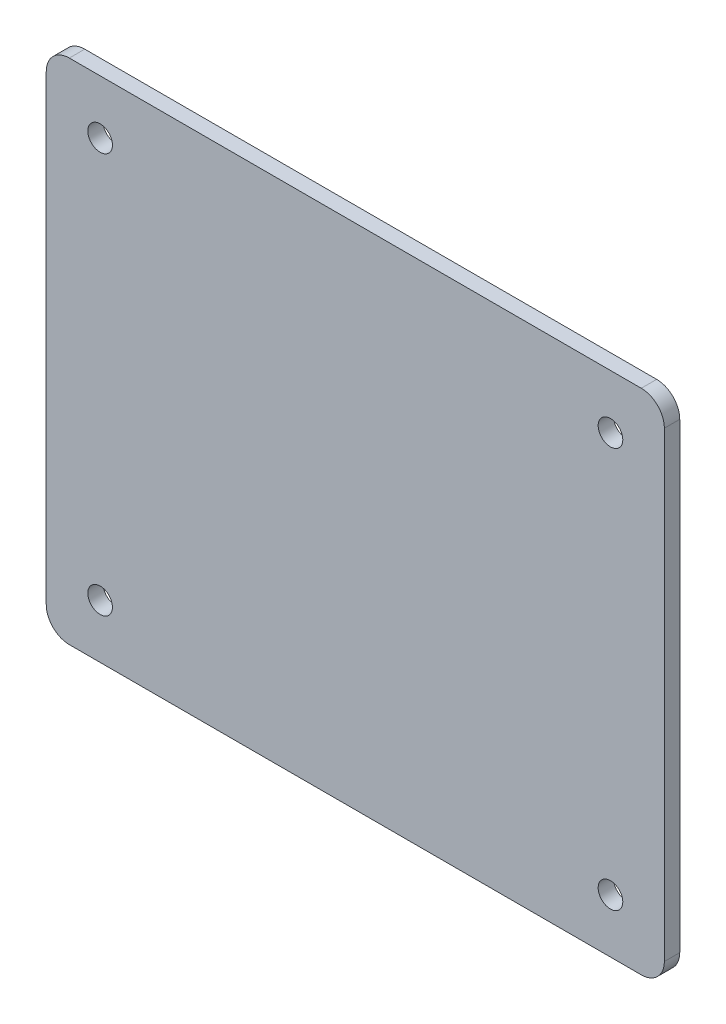
ISO-10303-21;
HEADER;
FILE_DESCRIPTION(('STEP AP214'),'2;1');
FILE_NAME('part.step','',(''),(''),'','','');
FILE_SCHEMA(('AUTOMOTIVE_DESIGN { 1 0 10303 214 1 1 1 1 }'));
ENDSEC;
DATA;
#1=APPLICATION_CONTEXT('core data for automotive mechanical design processes');
#2=APPLICATION_PROTOCOL_DEFINITION('international standard','automotive_design',2000,#1);
#3=PRODUCT_CONTEXT('',#1,'mechanical');
#4=PRODUCT('Part','Part','',(#3));
#5=PRODUCT_RELATED_PRODUCT_CATEGORY('part','',(#4));
#6=PRODUCT_DEFINITION_FORMATION('','',#4);
#7=PRODUCT_DEFINITION_CONTEXT('part definition',#1,'design');
#8=PRODUCT_DEFINITION('design','',#6,#7);
#9=PRODUCT_DEFINITION_SHAPE('','',#8);
#10=(LENGTH_UNIT() NAMED_UNIT(*) SI_UNIT(.MILLI.,.METRE.));
#11=(NAMED_UNIT(*) PLANE_ANGLE_UNIT() SI_UNIT($,.RADIAN.));
#12=(NAMED_UNIT(*) SI_UNIT($,.STERADIAN.) SOLID_ANGLE_UNIT());
#13=UNCERTAINTY_MEASURE_WITH_UNIT(LENGTH_MEASURE(1.E-05),#10,'distance_accuracy_value','');
#14=(GEOMETRIC_REPRESENTATION_CONTEXT(3) GLOBAL_UNCERTAINTY_ASSIGNED_CONTEXT((#13)) GLOBAL_UNIT_ASSIGNED_CONTEXT((#10,
#11,#12)) REPRESENTATION_CONTEXT('',''));
#15=CARTESIAN_POINT('',(0.,0.,0.));
#16=DIRECTION('',(0.,0.,1.));
#17=DIRECTION('',(1.,0.,0.));
#18=AXIS2_PLACEMENT_3D('',#15,#16,#17);
#19=CARTESIAN_POINT('',(0.,0.,2.));
#20=DIRECTION('',(1.,0.,0.));
#21=DIRECTION('',(0.,0.,-1.));
#22=AXIS2_PLACEMENT_3D('',#19,#20,#21);
#23=PLANE('',#22);
#24=DIRECTION('',(0.,-1.,0.));
#25=VECTOR('',#24,1.);
#26=CARTESIAN_POINT('',(0.,0.,0.));
#27=LINE('',#26,#25);
#28=CARTESIAN_POINT('',(0.,63.,0.));
#29=VERTEX_POINT('',#28);
#30=CARTESIAN_POINT('',(0.,3.,0.));
#31=VERTEX_POINT('',#30);
#32=EDGE_CURVE('E157',#29,#31,#27,.T.);
#33=ORIENTED_EDGE('',*,*,#32,.T.);
#34=DIRECTION('',(0.,0.,-1.));
#35=VECTOR('',#34,1.);
#36=CARTESIAN_POINT('',(0.,3.,2.));
#37=LINE('',#36,#35);
#38=CARTESIAN_POINT('',(0.,3.,2.));
#39=VERTEX_POINT('',#38);
#40=EDGE_CURVE('E11',#31,#39,#37,.F.);
#41=ORIENTED_EDGE('',*,*,#40,.T.);
#42=DIRECTION('',(0.,-1.,0.));
#43=VECTOR('',#42,1.);
#44=CARTESIAN_POINT('',(0.,0.,2.));
#45=LINE('',#44,#43);
#46=CARTESIAN_POINT('',(0.,63.,2.));
#47=VERTEX_POINT('',#46);
#48=EDGE_CURVE('E125',#47,#39,#45,.T.);
#49=ORIENTED_EDGE('',*,*,#48,.F.);
#50=DIRECTION('',(0.,0.,-1.));
#51=VECTOR('',#50,1.);
#52=CARTESIAN_POINT('',(0.,63.,2.));
#53=LINE('',#52,#51);
#54=EDGE_CURVE('E41',#47,#29,#53,.T.);
#55=ORIENTED_EDGE('',*,*,#54,.T.);
#56=EDGE_LOOP('',(#33,#41,#49,#55));
#57=FACE_BOUND('',#56,.T.);
#58=ADVANCED_FACE('F33',(#57),#23,.F.);
#59=CARTESIAN_POINT('',(0.,0.,2.));
#60=DIRECTION('',(0.,1.,0.));
#61=DIRECTION('',(0.,0.,1.));
#62=AXIS2_PLACEMENT_3D('',#59,#60,#61);
#63=PLANE('',#62);
#64=DIRECTION('',(1.,0.,0.));
#65=VECTOR('',#64,1.);
#66=CARTESIAN_POINT('',(0.,0.,0.));
#67=LINE('',#66,#65);
#68=CARTESIAN_POINT('',(3.,0.,0.));
#69=VERTEX_POINT('',#68);
#70=CARTESIAN_POINT('',(77.3,0.,0.));
#71=VERTEX_POINT('',#70);
#72=EDGE_CURVE('E130',#69,#71,#67,.T.);
#73=ORIENTED_EDGE('',*,*,#72,.T.);
#74=DIRECTION('',(0.,0.,-1.));
#75=VECTOR('',#74,1.);
#76=CARTESIAN_POINT('',(77.3,0.,2.));
#77=LINE('',#76,#75);
#78=CARTESIAN_POINT('',(77.3,0.,2.));
#79=VERTEX_POINT('',#78);
#80=EDGE_CURVE('E48',#71,#79,#77,.F.);
#81=ORIENTED_EDGE('',*,*,#80,.T.);
#82=DIRECTION('',(1.,0.,0.));
#83=VECTOR('',#82,1.);
#84=CARTESIAN_POINT('',(0.,0.,2.));
#85=LINE('',#84,#83);
#86=CARTESIAN_POINT('',(3.,0.,2.));
#87=VERTEX_POINT('',#86);
#88=EDGE_CURVE('E128',#87,#79,#85,.T.);
#89=ORIENTED_EDGE('',*,*,#88,.F.);
#90=DIRECTION('',(0.,0.,-1.));
#91=VECTOR('',#90,1.);
#92=CARTESIAN_POINT('',(3.,0.,2.));
#93=LINE('',#92,#91);
#94=EDGE_CURVE('E149',#87,#69,#93,.T.);
#95=ORIENTED_EDGE('',*,*,#94,.T.);
#96=EDGE_LOOP('',(#73,#81,#89,#95));
#97=FACE_BOUND('',#96,.T.);
#98=ADVANCED_FACE('F212',(#97),#63,.F.);
#99=CARTESIAN_POINT('',(80.3,0.,2.));
#100=DIRECTION('',(-1.,0.,0.));
#101=DIRECTION('',(0.,0.,1.));
#102=AXIS2_PLACEMENT_3D('',#99,#100,#101);
#103=PLANE('',#102);
#104=DIRECTION('',(0.,1.,0.));
#105=VECTOR('',#104,1.);
#106=CARTESIAN_POINT('',(80.3,0.,0.));
#107=LINE('',#106,#105);
#108=CARTESIAN_POINT('',(80.3,3.,0.));
#109=VERTEX_POINT('',#108);
#110=CARTESIAN_POINT('',(80.3,63.,0.));
#111=VERTEX_POINT('',#110);
#112=EDGE_CURVE('E126',#109,#111,#107,.T.);
#113=ORIENTED_EDGE('',*,*,#112,.T.);
#114=DIRECTION('',(0.,0.,-1.));
#115=VECTOR('',#114,1.);
#116=CARTESIAN_POINT('',(80.3,63.,2.));
#117=LINE('',#116,#115);
#118=CARTESIAN_POINT('',(80.3,63.,2.));
#119=VERTEX_POINT('',#118);
#120=EDGE_CURVE('E104',#111,#119,#117,.F.);
#121=ORIENTED_EDGE('',*,*,#120,.T.);
#122=DIRECTION('',(0.,1.,0.));
#123=VECTOR('',#122,1.);
#124=CARTESIAN_POINT('',(80.3,0.,2.));
#125=LINE('',#124,#123);
#126=CARTESIAN_POINT('',(80.3,3.,2.));
#127=VERTEX_POINT('',#126);
#128=EDGE_CURVE('E169',#127,#119,#125,.T.);
#129=ORIENTED_EDGE('',*,*,#128,.F.);
#130=DIRECTION('',(0.,0.,-1.));
#131=VECTOR('',#130,1.);
#132=CARTESIAN_POINT('',(80.3,3.,2.));
#133=LINE('',#132,#131);
#134=EDGE_CURVE('E109',#127,#109,#133,.T.);
#135=ORIENTED_EDGE('',*,*,#134,.T.);
#136=EDGE_LOOP('',(#113,#121,#129,#135));
#137=FACE_BOUND('',#136,.T.);
#138=ADVANCED_FACE('F209',(#137),#103,.F.);
#139=CARTESIAN_POINT('',(0.,66.,2.));
#140=DIRECTION('',(0.,-1.,0.));
#141=DIRECTION('',(0.,0.,-1.));
#142=AXIS2_PLACEMENT_3D('',#139,#140,#141);
#143=PLANE('',#142);
#144=DIRECTION('',(-1.,0.,0.));
#145=VECTOR('',#144,1.);
#146=CARTESIAN_POINT('',(0.,66.,2.));
#147=LINE('',#146,#145);
#148=CARTESIAN_POINT('',(77.3,66.,2.));
#149=VERTEX_POINT('',#148);
#150=CARTESIAN_POINT('',(3.,66.,2.));
#151=VERTEX_POINT('',#150);
#152=EDGE_CURVE('E119',#149,#151,#147,.T.);
#153=ORIENTED_EDGE('',*,*,#152,.F.);
#154=DIRECTION('',(0.,0.,-1.));
#155=VECTOR('',#154,1.);
#156=CARTESIAN_POINT('',(77.3,66.,2.));
#157=LINE('',#156,#155);
#158=CARTESIAN_POINT('',(77.3,66.,0.));
#159=VERTEX_POINT('',#158);
#160=EDGE_CURVE('E103',#149,#159,#157,.T.);
#161=ORIENTED_EDGE('',*,*,#160,.T.);
#162=DIRECTION('',(-1.,0.,0.));
#163=VECTOR('',#162,1.);
#164=CARTESIAN_POINT('',(0.,66.,0.));
#165=LINE('',#164,#163);
#166=CARTESIAN_POINT('',(3.,66.,0.));
#167=VERTEX_POINT('',#166);
#168=EDGE_CURVE('E116',#159,#167,#165,.T.);
#169=ORIENTED_EDGE('',*,*,#168,.T.);
#170=DIRECTION('',(0.,0.,-1.));
#171=VECTOR('',#170,1.);
#172=CARTESIAN_POINT('',(3.,66.,2.));
#173=LINE('',#172,#171);
#174=EDGE_CURVE('E121',#167,#151,#173,.F.);
#175=ORIENTED_EDGE('',*,*,#174,.T.);
#176=EDGE_LOOP('',(#153,#161,#169,#175));
#177=FACE_BOUND('',#176,.T.);
#178=ADVANCED_FACE('F115',(#177),#143,.F.);
#179=CARTESIAN_POINT('',(0.,0.,2.));
#180=DIRECTION('',(0.,0.,-1.));
#181=DIRECTION('',(-1.,0.,0.));
#182=AXIS2_PLACEMENT_3D('',#179,#180,#181);
#183=PLANE('',#182);
#184=CARTESIAN_POINT('',(7.,59.,2.));
#185=DIRECTION('',(0.,0.,1.));
#186=DIRECTION('',(1.,0.,0.));
#187=AXIS2_PLACEMENT_3D('',#184,#185,#186);
#188=CIRCLE('',#187,1.59999999999999);
#189=CARTESIAN_POINT('',(8.59999999999999,59.,2.));
#190=VERTEX_POINT('',#189);
#191=EDGE_CURVE('E190',#190,#190,#188,.T.);
#192=ORIENTED_EDGE('',*,*,#191,.F.);
#193=EDGE_LOOP('',(#192));
#194=FACE_BOUND('',#193,.T.);
#195=CARTESIAN_POINT('',(73.3,59.,2.));
#196=DIRECTION('',(0.,0.,1.));
#197=DIRECTION('',(1.,0.,0.));
#198=AXIS2_PLACEMENT_3D('',#195,#196,#197);
#199=CIRCLE('',#198,1.59999999999999);
#200=CARTESIAN_POINT('',(74.9,59.,2.));
#201=VERTEX_POINT('',#200);
#202=EDGE_CURVE('E184',#201,#201,#199,.T.);
#203=ORIENTED_EDGE('',*,*,#202,.F.);
#204=EDGE_LOOP('',(#203));
#205=FACE_BOUND('',#204,.T.);
#206=CARTESIAN_POINT('',(73.3,7.,2.));
#207=DIRECTION('',(0.,0.,1.));
#208=DIRECTION('',(1.,0.,0.));
#209=AXIS2_PLACEMENT_3D('',#206,#207,#208);
#210=CIRCLE('',#209,1.59999999999999);
#211=CARTESIAN_POINT('',(74.9,7.,2.));
#212=VERTEX_POINT('',#211);
#213=EDGE_CURVE('E178',#212,#212,#210,.T.);
#214=ORIENTED_EDGE('',*,*,#213,.F.);
#215=EDGE_LOOP('',(#214));
#216=FACE_BOUND('',#215,.T.);
#217=CARTESIAN_POINT('',(7.00000000000001,7.,2.));
#218=DIRECTION('',(0.,0.,1.));
#219=DIRECTION('',(1.,0.,0.));
#220=AXIS2_PLACEMENT_3D('',#217,#218,#219);
#221=CIRCLE('',#220,1.59999999999999);
#222=CARTESIAN_POINT('',(8.59999999999999,7.,2.));
#223=VERTEX_POINT('',#222);
#224=EDGE_CURVE('E165',#223,#223,#221,.T.);
#225=ORIENTED_EDGE('',*,*,#224,.F.);
#226=EDGE_LOOP('',(#225));
#227=FACE_BOUND('',#226,.T.);
#228=ORIENTED_EDGE('',*,*,#128,.T.);
#229=CARTESIAN_POINT('',(77.3,63.,2.));
#230=DIRECTION('',(0.,0.,-1.));
#231=DIRECTION('',(-1.,0.,0.));
#232=AXIS2_PLACEMENT_3D('',#229,#230,#231);
#233=CIRCLE('',#232,3.);
#234=EDGE_CURVE('E147',#119,#149,#233,.F.);
#235=ORIENTED_EDGE('',*,*,#234,.T.);
#236=ORIENTED_EDGE('',*,*,#152,.T.);
#237=CARTESIAN_POINT('',(3.,63.,2.));
#238=DIRECTION('',(0.,0.,-1.));
#239=DIRECTION('',(-1.,0.,0.));
#240=AXIS2_PLACEMENT_3D('',#237,#238,#239);
#241=CIRCLE('',#240,3.);
#242=EDGE_CURVE('E142',#151,#47,#241,.F.);
#243=ORIENTED_EDGE('',*,*,#242,.T.);
#244=ORIENTED_EDGE('',*,*,#48,.T.);
#245=CARTESIAN_POINT('',(3.,3.,2.));
#246=DIRECTION('',(0.,0.,-1.));
#247=DIRECTION('',(-1.,0.,0.));
#248=AXIS2_PLACEMENT_3D('',#245,#246,#247);
#249=CIRCLE('',#248,3.);
#250=EDGE_CURVE('E55',#39,#87,#249,.F.);
#251=ORIENTED_EDGE('',*,*,#250,.T.);
#252=ORIENTED_EDGE('',*,*,#88,.T.);
#253=CARTESIAN_POINT('',(77.3,3.,2.));
#254=DIRECTION('',(0.,0.,-1.));
#255=DIRECTION('',(-1.,0.,0.));
#256=AXIS2_PLACEMENT_3D('',#253,#254,#255);
#257=CIRCLE('',#256,3.);
#258=EDGE_CURVE('E145',#79,#127,#257,.F.);
#259=ORIENTED_EDGE('',*,*,#258,.T.);
#260=EDGE_LOOP('',(#228,#235,#236,#243,#244,#251,#252,#259));
#261=FACE_BOUND('',#260,.T.);
#262=ADVANCED_FACE('F196',(#194,#205,#216,#227,#261),#183,.F.);
#263=CARTESIAN_POINT('',(0.,0.,0.));
#264=DIRECTION('',(0.,0.,-1.));
#265=DIRECTION('',(-1.,0.,0.));
#266=AXIS2_PLACEMENT_3D('',#263,#264,#265);
#267=PLANE('',#266);
#268=CARTESIAN_POINT('',(7.,59.,0.));
#269=DIRECTION('',(0.,0.,1.));
#270=DIRECTION('',(1.,0.,0.));
#271=AXIS2_PLACEMENT_3D('',#268,#269,#270);
#272=CIRCLE('',#271,1.6);
#273=CARTESIAN_POINT('',(8.6,59.,0.));
#274=VERTEX_POINT('',#273);
#275=EDGE_CURVE('E187',#274,#274,#272,.T.);
#276=ORIENTED_EDGE('',*,*,#275,.T.);
#277=EDGE_LOOP('',(#276));
#278=FACE_BOUND('',#277,.T.);
#279=CARTESIAN_POINT('',(73.3,59.,0.));
#280=DIRECTION('',(0.,0.,1.));
#281=DIRECTION('',(1.,0.,0.));
#282=AXIS2_PLACEMENT_3D('',#279,#280,#281);
#283=CIRCLE('',#282,1.6);
#284=CARTESIAN_POINT('',(74.9,59.,0.));
#285=VERTEX_POINT('',#284);
#286=EDGE_CURVE('E181',#285,#285,#283,.T.);
#287=ORIENTED_EDGE('',*,*,#286,.T.);
#288=EDGE_LOOP('',(#287));
#289=FACE_BOUND('',#288,.T.);
#290=CARTESIAN_POINT('',(73.3,7.,0.));
#291=DIRECTION('',(0.,0.,1.));
#292=DIRECTION('',(1.,0.,0.));
#293=AXIS2_PLACEMENT_3D('',#290,#291,#292);
#294=CIRCLE('',#293,1.6);
#295=CARTESIAN_POINT('',(74.9,7.,0.));
#296=VERTEX_POINT('',#295);
#297=EDGE_CURVE('E175',#296,#296,#294,.T.);
#298=ORIENTED_EDGE('',*,*,#297,.T.);
#299=EDGE_LOOP('',(#298));
#300=FACE_BOUND('',#299,.T.);
#301=CARTESIAN_POINT('',(7.00000000000001,7.,0.));
#302=DIRECTION('',(0.,0.,1.));
#303=DIRECTION('',(1.,0.,0.));
#304=AXIS2_PLACEMENT_3D('',#301,#302,#303);
#305=CIRCLE('',#304,1.6);
#306=CARTESIAN_POINT('',(8.6,7.,0.));
#307=VERTEX_POINT('',#306);
#308=EDGE_CURVE('E162',#307,#307,#305,.T.);
#309=ORIENTED_EDGE('',*,*,#308,.T.);
#310=EDGE_LOOP('',(#309));
#311=FACE_BOUND('',#310,.T.);
#312=ORIENTED_EDGE('',*,*,#168,.F.);
#313=CARTESIAN_POINT('',(77.3,63.,0.));
#314=DIRECTION('',(0.,0.,-1.));
#315=DIRECTION('',(-1.,0.,0.));
#316=AXIS2_PLACEMENT_3D('',#313,#314,#315);
#317=CIRCLE('',#316,3.);
#318=EDGE_CURVE('E99',#159,#111,#317,.T.);
#319=ORIENTED_EDGE('',*,*,#318,.T.);
#320=ORIENTED_EDGE('',*,*,#112,.F.);
#321=CARTESIAN_POINT('',(77.3,3.,0.));
#322=DIRECTION('',(0.,0.,-1.));
#323=DIRECTION('',(-1.,0.,0.));
#324=AXIS2_PLACEMENT_3D('',#321,#322,#323);
#325=CIRCLE('',#324,3.);
#326=EDGE_CURVE('E110',#109,#71,#325,.T.);
#327=ORIENTED_EDGE('',*,*,#326,.T.);
#328=ORIENTED_EDGE('',*,*,#72,.F.);
#329=CARTESIAN_POINT('',(3.,3.,0.));
#330=DIRECTION('',(0.,0.,-1.));
#331=DIRECTION('',(-1.,0.,0.));
#332=AXIS2_PLACEMENT_3D('',#329,#330,#331);
#333=CIRCLE('',#332,3.);
#334=EDGE_CURVE('E136',#69,#31,#333,.T.);
#335=ORIENTED_EDGE('',*,*,#334,.T.);
#336=ORIENTED_EDGE('',*,*,#32,.F.);
#337=CARTESIAN_POINT('',(3.,63.,0.));
#338=DIRECTION('',(0.,0.,-1.));
#339=DIRECTION('',(-1.,0.,0.));
#340=AXIS2_PLACEMENT_3D('',#337,#338,#339);
#341=CIRCLE('',#340,3.);
#342=EDGE_CURVE('E120',#29,#167,#341,.T.);
#343=ORIENTED_EDGE('',*,*,#342,.T.);
#344=EDGE_LOOP('',(#312,#319,#320,#327,#328,#335,#336,#343));
#345=FACE_BOUND('',#344,.T.);
#346=ADVANCED_FACE('F123',(#278,#289,#300,#311,#345),#267,.T.);
#347=CARTESIAN_POINT('',(7.00000000000001,7.,2.));
#348=DIRECTION('',(0.,0.,1.));
#349=DIRECTION('',(1.,0.,0.));
#350=AXIS2_PLACEMENT_3D('',#347,#348,#349);
#351=CYLINDRICAL_SURFACE('',#350,1.59999999999999);
#352=ORIENTED_EDGE('',*,*,#308,.F.);
#353=EDGE_LOOP('',(#352));
#354=FACE_BOUND('',#353,.T.);
#355=ORIENTED_EDGE('',*,*,#224,.T.);
#356=EDGE_LOOP('',(#355));
#357=FACE_BOUND('',#356,.T.);
#358=ADVANCED_FACE('F278',(#354,#357),#351,.F.);
#359=CARTESIAN_POINT('',(73.3,7.,2.));
#360=DIRECTION('',(0.,0.,1.));
#361=DIRECTION('',(1.,0.,0.));
#362=AXIS2_PLACEMENT_3D('',#359,#360,#361);
#363=CYLINDRICAL_SURFACE('',#362,1.6);
#364=ORIENTED_EDGE('',*,*,#297,.F.);
#365=EDGE_LOOP('',(#364));
#366=FACE_BOUND('',#365,.T.);
#367=ORIENTED_EDGE('',*,*,#213,.T.);
#368=EDGE_LOOP('',(#367));
#369=FACE_BOUND('',#368,.T.);
#370=ADVANCED_FACE('F269',(#366,#369),#363,.F.);
#371=CARTESIAN_POINT('',(73.3,59.,2.));
#372=DIRECTION('',(0.,0.,1.));
#373=DIRECTION('',(1.,0.,0.));
#374=AXIS2_PLACEMENT_3D('',#371,#372,#373);
#375=CYLINDRICAL_SURFACE('',#374,1.6);
#376=ORIENTED_EDGE('',*,*,#286,.F.);
#377=EDGE_LOOP('',(#376));
#378=FACE_BOUND('',#377,.T.);
#379=ORIENTED_EDGE('',*,*,#202,.T.);
#380=EDGE_LOOP('',(#379));
#381=FACE_BOUND('',#380,.T.);
#382=ADVANCED_FACE('F260',(#378,#381),#375,.F.);
#383=CARTESIAN_POINT('',(7.,59.,2.));
#384=DIRECTION('',(0.,0.,1.));
#385=DIRECTION('',(1.,0.,0.));
#386=AXIS2_PLACEMENT_3D('',#383,#384,#385);
#387=CYLINDRICAL_SURFACE('',#386,1.59999999999999);
#388=ORIENTED_EDGE('',*,*,#275,.F.);
#389=EDGE_LOOP('',(#388));
#390=FACE_BOUND('',#389,.T.);
#391=ORIENTED_EDGE('',*,*,#191,.T.);
#392=EDGE_LOOP('',(#391));
#393=FACE_BOUND('',#392,.T.);
#394=ADVANCED_FACE('F194',(#390,#393),#387,.F.);
#395=CARTESIAN_POINT('',(77.3,63.,2.));
#396=DIRECTION('',(0.,0.,-1.));
#397=DIRECTION('',(-1.,0.,0.));
#398=AXIS2_PLACEMENT_3D('',#395,#396,#397);
#399=CYLINDRICAL_SURFACE('',#398,3.);
#400=ORIENTED_EDGE('',*,*,#234,.F.);
#401=ORIENTED_EDGE('',*,*,#120,.F.);
#402=ORIENTED_EDGE('',*,*,#318,.F.);
#403=ORIENTED_EDGE('',*,*,#160,.F.);
#404=EDGE_LOOP('',(#400,#401,#402,#403));
#405=FACE_BOUND('',#404,.T.);
#406=ADVANCED_FACE('F102',(#405),#399,.T.);
#407=CARTESIAN_POINT('',(77.3,3.,2.));
#408=DIRECTION('',(0.,0.,-1.));
#409=DIRECTION('',(-1.,0.,0.));
#410=AXIS2_PLACEMENT_3D('',#407,#408,#409);
#411=CYLINDRICAL_SURFACE('',#410,3.);
#412=ORIENTED_EDGE('',*,*,#258,.F.);
#413=ORIENTED_EDGE('',*,*,#80,.F.);
#414=ORIENTED_EDGE('',*,*,#326,.F.);
#415=ORIENTED_EDGE('',*,*,#134,.F.);
#416=EDGE_LOOP('',(#412,#413,#414,#415));
#417=FACE_BOUND('',#416,.T.);
#418=ADVANCED_FACE('F211',(#417),#411,.T.);
#419=CARTESIAN_POINT('',(3.,3.,2.));
#420=DIRECTION('',(0.,0.,-1.));
#421=DIRECTION('',(-1.,0.,0.));
#422=AXIS2_PLACEMENT_3D('',#419,#420,#421);
#423=CYLINDRICAL_SURFACE('',#422,3.);
#424=ORIENTED_EDGE('',*,*,#250,.F.);
#425=ORIENTED_EDGE('',*,*,#40,.F.);
#426=ORIENTED_EDGE('',*,*,#334,.F.);
#427=ORIENTED_EDGE('',*,*,#94,.F.);
#428=EDGE_LOOP('',(#424,#425,#426,#427));
#429=FACE_BOUND('',#428,.T.);
#430=ADVANCED_FACE('F215',(#429),#423,.T.);
#431=CARTESIAN_POINT('',(3.,63.,2.));
#432=DIRECTION('',(0.,0.,-1.));
#433=DIRECTION('',(-1.,0.,0.));
#434=AXIS2_PLACEMENT_3D('',#431,#432,#433);
#435=CYLINDRICAL_SURFACE('',#434,3.);
#436=ORIENTED_EDGE('',*,*,#242,.F.);
#437=ORIENTED_EDGE('',*,*,#174,.F.);
#438=ORIENTED_EDGE('',*,*,#342,.F.);
#439=ORIENTED_EDGE('',*,*,#54,.F.);
#440=EDGE_LOOP('',(#436,#437,#438,#439));
#441=FACE_BOUND('',#440,.T.);
#442=ADVANCED_FACE('F35',(#441),#435,.T.);
#443=CLOSED_SHELL('',(#58,#98,#138,#178,#262,#346,#358,#370,#382,#394,#406,#418,#430,#442));
#444=MANIFOLD_SOLID_BREP('B2',#443);
#445=ADVANCED_BREP_SHAPE_REPRESENTATION('',(#18,#444),#14);
#446=SHAPE_DEFINITION_REPRESENTATION(#9,#445);
ENDSEC;
END-ISO-10303-21;
